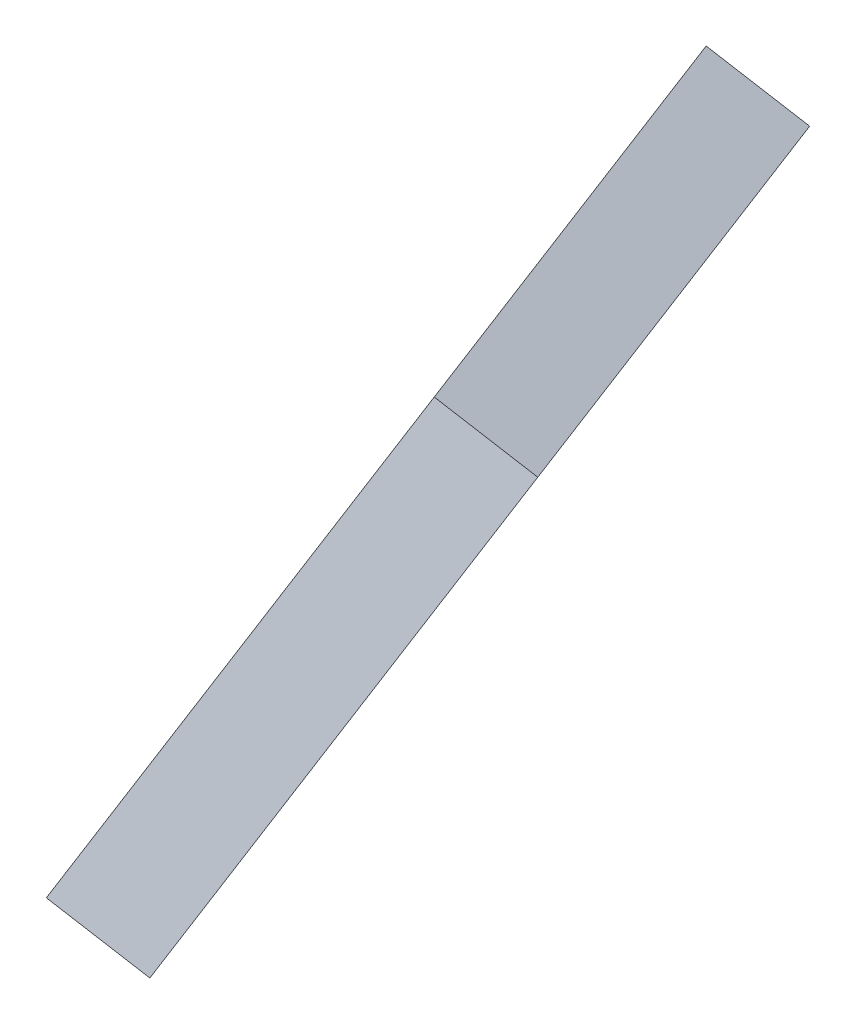
ISO-10303-21;
HEADER;
FILE_DESCRIPTION(('STEP AP214'),'2;1');
FILE_NAME('part.step','',(''),(''),'','','');
FILE_SCHEMA(('AUTOMOTIVE_DESIGN { 1 0 10303 214 1 1 1 1 }'));
ENDSEC;
DATA;
#1=APPLICATION_CONTEXT('core data for automotive mechanical design processes');
#2=APPLICATION_PROTOCOL_DEFINITION('international standard','automotive_design',2000,#1);
#3=PRODUCT_CONTEXT('',#1,'mechanical');
#4=PRODUCT('Part','Part','',(#3));
#5=PRODUCT_RELATED_PRODUCT_CATEGORY('part','',(#4));
#6=PRODUCT_DEFINITION_FORMATION('','',#4);
#7=PRODUCT_DEFINITION_CONTEXT('part definition',#1,'design');
#8=PRODUCT_DEFINITION('design','',#6,#7);
#9=PRODUCT_DEFINITION_SHAPE('','',#8);
#10=(LENGTH_UNIT() NAMED_UNIT(*) SI_UNIT(.MILLI.,.METRE.));
#11=(NAMED_UNIT(*) PLANE_ANGLE_UNIT() SI_UNIT($,.RADIAN.));
#12=(NAMED_UNIT(*) SI_UNIT($,.STERADIAN.) SOLID_ANGLE_UNIT());
#13=UNCERTAINTY_MEASURE_WITH_UNIT(LENGTH_MEASURE(1.E-05),#10,'distance_accuracy_value','');
#14=(GEOMETRIC_REPRESENTATION_CONTEXT(3) GLOBAL_UNCERTAINTY_ASSIGNED_CONTEXT((#13)) GLOBAL_UNIT_ASSIGNED_CONTEXT((#10,
#11,#12)) REPRESENTATION_CONTEXT('',''));
#15=CARTESIAN_POINT('',(0.,0.,0.));
#16=DIRECTION('',(0.,0.,1.));
#17=DIRECTION('',(1.,0.,0.));
#18=AXIS2_PLACEMENT_3D('',#15,#16,#17);
#19=CARTESIAN_POINT('',(19.5007961809616,46.9234967551578,45.2554960806359));
#20=DIRECTION('',(0.356822089773025,-1.3782920117722E-13,0.934172358962741));
#21=DIRECTION('',(0.934172358962741,0.,-0.356822089773025));
#22=AXIS2_PLACEMENT_3D('',#19,#20,#21);
#23=PLANE('',#22);
#24=DIRECTION('',(0.46708617947945,0.866025403785652,-0.178411044885651));
#25=VECTOR('',#24,1.);
#26=CARTESIAN_POINT('',(17.2355485967086,48.3234967551519,46.1207436648869));
#27=LINE('',#26,#25);
#28=CARTESIAN_POINT('',(17.2355485967086,48.3234967551519,46.1207436648869));
#29=VERTEX_POINT('',#28);
#30=CARTESIAN_POINT('',(21.9389360973558,57.0440567681838,44.3242095019028));
#31=VERTEX_POINT('',#30);
#32=EDGE_CURVE('E136',#29,#31,#27,.T.);
#33=ORIENTED_EDGE('',*,*,#32,.T.);
#34=DIRECTION('',(-0.809016994376078,0.499999999997899,0.309016994375388));
#35=VECTOR('',#34,1.);
#36=CARTESIAN_POINT('',(24.2041836816088,55.6440567681897,43.4589619176517));
#37=LINE('',#36,#35);
#38=CARTESIAN_POINT('',(24.2041836816088,55.6440567681897,43.4589619176517));
#39=VERTEX_POINT('',#38);
#40=EDGE_CURVE('E11',#39,#31,#37,.T.);
#41=ORIENTED_EDGE('',*,*,#40,.F.);
#42=DIRECTION('',(0.46708617947945,0.866025403785652,-0.178411044885651));
#43=VECTOR('',#42,1.);
#44=CARTESIAN_POINT('',(19.5007961809616,46.9234967551578,45.2554960806359));
#45=LINE('',#44,#43);
#46=CARTESIAN_POINT('',(19.5007961809616,46.9234967551578,45.2554960806359));
#47=VERTEX_POINT('',#46);
#48=EDGE_CURVE('E152',#47,#39,#45,.T.);
#49=ORIENTED_EDGE('',*,*,#48,.F.);
#50=DIRECTION('',(-0.809016994376078,0.499999999997899,0.309016994375388));
#51=VECTOR('',#50,1.);
#52=CARTESIAN_POINT('',(19.5007961809616,46.9234967551578,45.2554960806359));
#53=LINE('',#52,#51);
#54=EDGE_CURVE('E132',#47,#29,#53,.T.);
#55=ORIENTED_EDGE('',*,*,#54,.T.);
#56=EDGE_LOOP('',(#33,#41,#49,#55));
#57=FACE_BOUND('',#56,.T.);
#58=ADVANCED_FACE('F34',(#57),#23,.F.);
#59=CARTESIAN_POINT('',(24.2041836816088,55.6440567681897,43.4589619176517));
#60=DIRECTION('',(-0.461391060972473,-0.865917336411934,0.193146202023125));
#61=DIRECTION('',(0.882535490608883,-0.470245795106919,0.));
#62=AXIS2_PLACEMENT_3D('',#59,#60,#61);
#63=PLANE('',#62);
#64=DIRECTION('',(0.364156273686714,0.0136808809425178,0.931237371367389));
#65=VECTOR('',#64,1.);
#66=CARTESIAN_POINT('',(21.9389360973558,57.0440567681838,44.3242095019028));
#67=LINE('',#66,#65);
#68=CARTESIAN_POINT('',(27.2192020658132,57.2424295418503,57.8271513867299));
#69=VERTEX_POINT('',#68);
#70=EDGE_CURVE('E139',#31,#69,#67,.T.);
#71=ORIENTED_EDGE('',*,*,#70,.T.);
#72=DIRECTION('',(-0.809016994376078,0.499999999997899,0.309016994375388));
#73=VECTOR('',#72,1.);
#74=CARTESIAN_POINT('',(29.4844496500662,55.8424295418562,56.9619038024789));
#75=LINE('',#74,#73);
#76=CARTESIAN_POINT('',(29.4844496500662,55.8424295418562,56.9619038024789));
#77=VERTEX_POINT('',#76);
#78=EDGE_CURVE('E42',#77,#69,#75,.T.);
#79=ORIENTED_EDGE('',*,*,#78,.F.);
#80=DIRECTION('',(0.364156273686714,0.0136808809425178,0.931237371367389));
#81=VECTOR('',#80,1.);
#82=CARTESIAN_POINT('',(24.2041836816088,55.6440567681897,43.4589619176517));
#83=LINE('',#82,#81);
#84=EDGE_CURVE('E96',#39,#77,#83,.T.);
#85=ORIENTED_EDGE('',*,*,#84,.F.);
#86=ORIENTED_EDGE('',*,*,#40,.T.);
#87=EDGE_LOOP('',(#71,#79,#85,#86));
#88=FACE_BOUND('',#87,.T.);
#89=ADVANCED_FACE('F195',(#88),#63,.F.);
#90=CARTESIAN_POINT('',(25.0037032316556,44.1116831234028,64.211903802468));
#91=DIRECTION('',(-0.499999999999289,-0.30901699437533,-0.809016994375241));
#92=DIRECTION('',(-0.85065080835246,0.,0.525731112118454));
#93=AXIS2_PLACEMENT_3D('',#90,#91,#92);
#94=PLANE('',#93);
#95=DIRECTION('',(-0.30901699437314,-0.8090169943761,0.499999999999252));
#96=VECTOR('',#95,1.);
#97=CARTESIAN_POINT('',(22.7384556474026,45.5116831233969,65.0771513867191));
#98=LINE('',#97,#96);
#99=CARTESIAN_POINT('',(22.7384556474026,45.5116831233969,65.0771513867191));
#100=VERTEX_POINT('',#99);
#101=EDGE_CURVE('E141',#69,#100,#98,.T.);
#102=ORIENTED_EDGE('',*,*,#101,.T.);
#103=DIRECTION('',(-0.809016994376078,0.499999999997899,0.309016994375388));
#104=VECTOR('',#103,1.);
#105=CARTESIAN_POINT('',(25.0037032316556,44.1116831234028,64.211903802468));
#106=LINE('',#105,#104);
#107=CARTESIAN_POINT('',(25.0037032316556,44.1116831234028,64.211903802468));
#108=VERTEX_POINT('',#107);
#109=EDGE_CURVE('E162',#108,#100,#106,.T.);
#110=ORIENTED_EDGE('',*,*,#109,.F.);
#111=DIRECTION('',(-0.30901699437314,-0.8090169943761,0.499999999999252));
#112=VECTOR('',#111,1.);
#113=CARTESIAN_POINT('',(25.0037032316556,44.1116831234028,64.211903802468));
#114=LINE('',#113,#112);
#115=EDGE_CURVE('E170',#77,#108,#114,.T.);
#116=ORIENTED_EDGE('',*,*,#115,.F.);
#117=ORIENTED_EDGE('',*,*,#78,.T.);
#118=EDGE_LOOP('',(#102,#110,#116,#117));
#119=FACE_BOUND('',#118,.T.);
#120=ADVANCED_FACE('F168',(#119),#94,.F.);
#121=CARTESIAN_POINT('',(16.6584261987368,35.8890072070231,55.6682539958557));
#122=DIRECTION('',(0.119370917647287,0.654537262999296,-0.746546418761376));
#123=DIRECTION('',(0.,0.751922871196078,0.659251087046693));
#124=AXIS2_PLACEMENT_3D('',#121,#122,#123);
#125=PLANE('',#124);
#126=DIRECTION('',(-0.575536347097855,-0.567081097681357,-0.589217228042227));
#127=VECTOR('',#126,1.);
#128=CARTESIAN_POINT('',(14.3931786144837,37.2890072070172,56.5335015801068));
#129=LINE('',#128,#127);
#130=CARTESIAN_POINT('',(14.3931786144837,37.2890072070172,56.5335015801068));
#131=VERTEX_POINT('',#130);
#132=EDGE_CURVE('E143',#100,#131,#129,.T.);
#133=ORIENTED_EDGE('',*,*,#132,.T.);
#134=DIRECTION('',(-0.809016994376078,0.499999999997899,0.309016994375388));
#135=VECTOR('',#134,1.);
#136=CARTESIAN_POINT('',(16.6584261987368,35.8890072070231,55.6682539958557));
#137=LINE('',#136,#135);
#138=CARTESIAN_POINT('',(16.6584261987368,35.8890072070231,55.6682539958557));
#139=VERTEX_POINT('',#138);
#140=EDGE_CURVE('E159',#139,#131,#137,.T.);
#141=ORIENTED_EDGE('',*,*,#140,.F.);
#142=DIRECTION('',(-0.575536347097855,-0.567081097681357,-0.589217228042227));
#143=VECTOR('',#142,1.);
#144=CARTESIAN_POINT('',(16.6584261987368,35.8890072070231,55.6682539958557));
#145=LINE('',#144,#143);
#146=EDGE_CURVE('E186',#108,#139,#145,.T.);
#147=ORIENTED_EDGE('',*,*,#146,.F.);
#148=ORIENTED_EDGE('',*,*,#109,.T.);
#149=EDGE_LOOP('',(#133,#141,#147,#148));
#150=FACE_BOUND('',#149,.T.);
#151=ADVANCED_FACE('F179',(#150),#125,.F.);
#152=CARTESIAN_POINT('',(17.7687453734024,42.3889288706932,48.0580131575201));
#153=DIRECTION('',(0.577350269188322,0.577350269190428,0.577350269190127));
#154=DIRECTION('',(0.,-0.707106781186363,0.707106781186732));
#155=AXIS2_PLACEMENT_3D('',#152,#153,#154);
#156=PLANE('',#155);
#157=DIRECTION('',(0.110264089706803,0.645497224368813,-0.755761314075607));
#158=VECTOR('',#157,1.);
#159=CARTESIAN_POINT('',(15.5034977891493,43.7889288706874,48.9232607417712));
#160=LINE('',#159,#158);
#161=CARTESIAN_POINT('',(15.5034977891493,43.7889288706874,48.9232607417712));
#162=VERTEX_POINT('',#161);
#163=EDGE_CURVE('E145',#131,#162,#160,.T.);
#164=ORIENTED_EDGE('',*,*,#163,.T.);
#165=DIRECTION('',(-0.809016994376078,0.499999999997899,0.309016994375388));
#166=VECTOR('',#165,1.);
#167=CARTESIAN_POINT('',(17.7687453734024,42.3889288706932,48.0580131575201));
#168=LINE('',#167,#166);
#169=CARTESIAN_POINT('',(17.7687453734024,42.3889288706932,48.0580131575201));
#170=VERTEX_POINT('',#169);
#171=EDGE_CURVE('E156',#170,#162,#168,.T.);
#172=ORIENTED_EDGE('',*,*,#171,.F.);
#173=DIRECTION('',(0.110264089706803,0.645497224368813,-0.755761314075607));
#174=VECTOR('',#173,1.);
#175=CARTESIAN_POINT('',(17.7687453734024,42.3889288706932,48.0580131575201));
#176=LINE('',#175,#174);
#177=EDGE_CURVE('E185',#139,#170,#176,.T.);
#178=ORIENTED_EDGE('',*,*,#177,.F.);
#179=ORIENTED_EDGE('',*,*,#140,.T.);
#180=EDGE_LOOP('',(#164,#172,#178,#179));
#181=FACE_BOUND('',#180,.T.);
#182=ADVANCED_FACE('F183',(#181),#156,.F.);
#183=CARTESIAN_POINT('',(16.0366945658374,40.6568780631219,46.3259623499497));
#184=DIRECTION('',(0.1102640897068,0.64549722436881,-0.75576131407561));
#185=DIRECTION('',(0.,0.760397974221228,0.649457404916022));
#186=AXIS2_PLACEMENT_3D('',#183,#184,#185);
#187=PLANE('',#186);
#188=DIRECTION('',(-0.577350269188324,-0.577350269190431,-0.577350269190123));
#189=VECTOR('',#188,1.);
#190=CARTESIAN_POINT('',(13.7714469815843,42.056878063116,47.1912099342008));
#191=LINE('',#190,#189);
#192=CARTESIAN_POINT('',(13.7714469815843,42.056878063116,47.1912099342008));
#193=VERTEX_POINT('',#192);
#194=EDGE_CURVE('E147',#162,#193,#191,.T.);
#195=ORIENTED_EDGE('',*,*,#194,.T.);
#196=DIRECTION('',(-0.809016994376078,0.499999999997899,0.309016994375388));
#197=VECTOR('',#196,1.);
#198=CARTESIAN_POINT('',(16.0366945658374,40.6568780631219,46.3259623499497));
#199=LINE('',#198,#197);
#200=CARTESIAN_POINT('',(16.0366945658374,40.6568780631219,46.3259623499497));
#201=VERTEX_POINT('',#200);
#202=EDGE_CURVE('E127',#201,#193,#199,.T.);
#203=ORIENTED_EDGE('',*,*,#202,.F.);
#204=DIRECTION('',(-0.577350269188324,-0.577350269190431,-0.577350269190123));
#205=VECTOR('',#204,1.);
#206=CARTESIAN_POINT('',(16.0366945658374,40.6568780631219,46.3259623499497));
#207=LINE('',#206,#205);
#208=EDGE_CURVE('E118',#170,#201,#207,.T.);
#209=ORIENTED_EDGE('',*,*,#208,.F.);
#210=ORIENTED_EDGE('',*,*,#171,.T.);
#211=EDGE_LOOP('',(#195,#203,#209,#210));
#212=FACE_BOUND('',#211,.T.);
#213=ADVANCED_FACE('F207',(#212),#187,.F.);
#214=CARTESIAN_POINT('',(16.493838238546,43.3330437364237,43.1926530039393));
#215=DIRECTION('',(0.577350269188321,0.577350269190424,0.577350269190132));
#216=DIRECTION('',(0.,-0.707106781186369,0.707106781186726));
#217=AXIS2_PLACEMENT_3D('',#214,#215,#216);
#218=PLANE('',#217);
#219=DIRECTION('',(0.110264089706808,0.645497224368816,-0.755761314075604));
#220=VECTOR('',#219,1.);
#221=CARTESIAN_POINT('',(14.228590654293,44.7330437364178,44.0579005881904));
#222=LINE('',#221,#220);
#223=CARTESIAN_POINT('',(14.228590654293,44.7330437364178,44.0579005881904));
#224=VERTEX_POINT('',#223);
#225=EDGE_CURVE('E126',#193,#224,#222,.T.);
#226=ORIENTED_EDGE('',*,*,#225,.T.);
#227=DIRECTION('',(-0.809016994376078,0.499999999997899,0.309016994375388));
#228=VECTOR('',#227,1.);
#229=CARTESIAN_POINT('',(16.493838238546,43.3330437364237,43.1926530039393));
#230=LINE('',#229,#228);
#231=CARTESIAN_POINT('',(16.493838238546,43.3330437364237,43.1926530039393));
#232=VERTEX_POINT('',#231);
#233=EDGE_CURVE('E123',#232,#224,#230,.T.);
#234=ORIENTED_EDGE('',*,*,#233,.F.);
#235=DIRECTION('',(0.110264089706808,0.645497224368816,-0.755761314075604));
#236=VECTOR('',#235,1.);
#237=CARTESIAN_POINT('',(16.493838238546,43.3330437364237,43.1926530039393));
#238=LINE('',#237,#236);
#239=EDGE_CURVE('E112',#201,#232,#238,.T.);
#240=ORIENTED_EDGE('',*,*,#239,.F.);
#241=ORIENTED_EDGE('',*,*,#202,.T.);
#242=EDGE_LOOP('',(#226,#234,#240,#241));
#243=FACE_BOUND('',#242,.T.);
#244=ADVANCED_FACE('F124',(#243),#218,.F.);
#245=CARTESIAN_POINT('',(18.4303299116423,46.9234967551578,42.4529790037477));
#246=DIRECTION('',(0.356822089773095,0.,0.934172358962714));
#247=DIRECTION('',(0.934172358962714,0.,-0.356822089773095));
#248=AXIS2_PLACEMENT_3D('',#245,#246,#247);
#249=PLANE('',#248);
#250=DIRECTION('',(0.467086179479395,0.866025403785653,-0.178411044885791));
#251=VECTOR('',#250,1.);
#252=CARTESIAN_POINT('',(16.1650823273893,48.3234967551519,43.3182265879988));
#253=LINE('',#252,#251);
#254=CARTESIAN_POINT('',(16.1650823273893,48.3234967551519,43.3182265879988));
#255=VERTEX_POINT('',#254);
#256=EDGE_CURVE('E82',#224,#255,#253,.T.);
#257=ORIENTED_EDGE('',*,*,#256,.T.);
#258=DIRECTION('',(-0.809016994376078,0.499999999997899,0.309016994375388));
#259=VECTOR('',#258,1.);
#260=CARTESIAN_POINT('',(18.4303299116423,46.9234967551578,42.4529790037477));
#261=LINE('',#260,#259);
#262=CARTESIAN_POINT('',(18.4303299116423,46.9234967551578,42.4529790037477));
#263=VERTEX_POINT('',#262);
#264=EDGE_CURVE('E128',#263,#255,#261,.T.);
#265=ORIENTED_EDGE('',*,*,#264,.F.);
#266=DIRECTION('',(0.467086179479395,0.866025403785653,-0.178411044885791));
#267=VECTOR('',#266,1.);
#268=CARTESIAN_POINT('',(18.4303299116423,46.9234967551578,42.4529790037477));
#269=LINE('',#268,#267);
#270=EDGE_CURVE('E116',#232,#263,#269,.T.);
#271=ORIENTED_EDGE('',*,*,#270,.F.);
#272=ORIENTED_EDGE('',*,*,#233,.T.);
#273=EDGE_LOOP('',(#257,#265,#271,#272));
#274=FACE_BOUND('',#273,.T.);
#275=ADVANCED_FACE('F130',(#274),#249,.F.);
#276=CARTESIAN_POINT('',(19.5007961809616,46.9234967551578,45.2554960806359));
#277=DIRECTION('',(-0.467086179479396,-0.866025403785652,0.178411044885793));
#278=DIRECTION('',(0.880146433299669,-0.474702281382627,0.));
#279=AXIS2_PLACEMENT_3D('',#276,#277,#278);
#280=PLANE('',#279);
#281=DIRECTION('',(0.356822089773096,0.,0.934172358962713));
#282=VECTOR('',#281,1.);
#283=CARTESIAN_POINT('',(17.2355485967086,48.3234967551519,46.1207436648869));
#284=LINE('',#283,#282);
#285=EDGE_CURVE('E88',#255,#29,#284,.T.);
#286=ORIENTED_EDGE('',*,*,#285,.T.);
#287=ORIENTED_EDGE('',*,*,#54,.F.);
#288=DIRECTION('',(0.356822089773096,0.,0.934172358962713));
#289=VECTOR('',#288,1.);
#290=CARTESIAN_POINT('',(19.5007961809616,46.9234967551578,45.2554960806359));
#291=LINE('',#290,#289);
#292=EDGE_CURVE('E50',#263,#47,#291,.T.);
#293=ORIENTED_EDGE('',*,*,#292,.F.);
#294=ORIENTED_EDGE('',*,*,#264,.T.);
#295=EDGE_LOOP('',(#286,#287,#293,#294));
#296=FACE_BOUND('',#295,.T.);
#297=ADVANCED_FACE('F215',(#296),#280,.F.);
#298=CARTESIAN_POINT('',(-17.5313903729518,10.8349951204662,6.6963952524251));
#299=DIRECTION('',(-0.809016994376077,0.499999999997899,0.309016994375389));
#300=DIRECTION('',(-0.525731112117004,-0.850650808353356,0.));
#301=AXIS2_PLACEMENT_3D('',#298,#299,#300);
#302=PLANE('',#301);
#303=ORIENTED_EDGE('',*,*,#48,.T.);
#304=ORIENTED_EDGE('',*,*,#84,.T.);
#305=ORIENTED_EDGE('',*,*,#115,.T.);
#306=ORIENTED_EDGE('',*,*,#146,.T.);
#307=ORIENTED_EDGE('',*,*,#177,.T.);
#308=ORIENTED_EDGE('',*,*,#208,.T.);
#309=ORIENTED_EDGE('',*,*,#239,.T.);
#310=ORIENTED_EDGE('',*,*,#270,.T.);
#311=ORIENTED_EDGE('',*,*,#292,.T.);
#312=EDGE_LOOP('',(#303,#304,#305,#306,#307,#308,#309,#310,#311));
#313=FACE_BOUND('',#312,.T.);
#314=ADVANCED_FACE('F114',(#313),#302,.F.);
#315=CARTESIAN_POINT('',(-19.7966379572048,12.2349951204604,7.56164283667618));
#316=DIRECTION('',(-0.809016994376077,0.499999999997899,0.309016994375389));
#317=DIRECTION('',(-0.525731112117004,-0.850650808353356,0.));
#318=AXIS2_PLACEMENT_3D('',#315,#316,#317);
#319=PLANE('',#318);
#320=ORIENTED_EDGE('',*,*,#32,.F.);
#321=ORIENTED_EDGE('',*,*,#285,.F.);
#322=ORIENTED_EDGE('',*,*,#256,.F.);
#323=ORIENTED_EDGE('',*,*,#225,.F.);
#324=ORIENTED_EDGE('',*,*,#194,.F.);
#325=ORIENTED_EDGE('',*,*,#163,.F.);
#326=ORIENTED_EDGE('',*,*,#132,.F.);
#327=ORIENTED_EDGE('',*,*,#101,.F.);
#328=ORIENTED_EDGE('',*,*,#70,.F.);
#329=EDGE_LOOP('',(#320,#321,#322,#323,#324,#325,#326,#327,#328));
#330=FACE_BOUND('',#329,.T.);
#331=ADVANCED_FACE('F174',(#330),#319,.T.);
#332=CLOSED_SHELL('',(#58,#89,#120,#151,#182,#213,#244,#275,#297,#314,#331));
#333=MANIFOLD_SOLID_BREP('B2',#332);
#334=ADVANCED_BREP_SHAPE_REPRESENTATION('',(#18,#333),#14);
#335=SHAPE_DEFINITION_REPRESENTATION(#9,#334);
ENDSEC;
END-ISO-10303-21;
